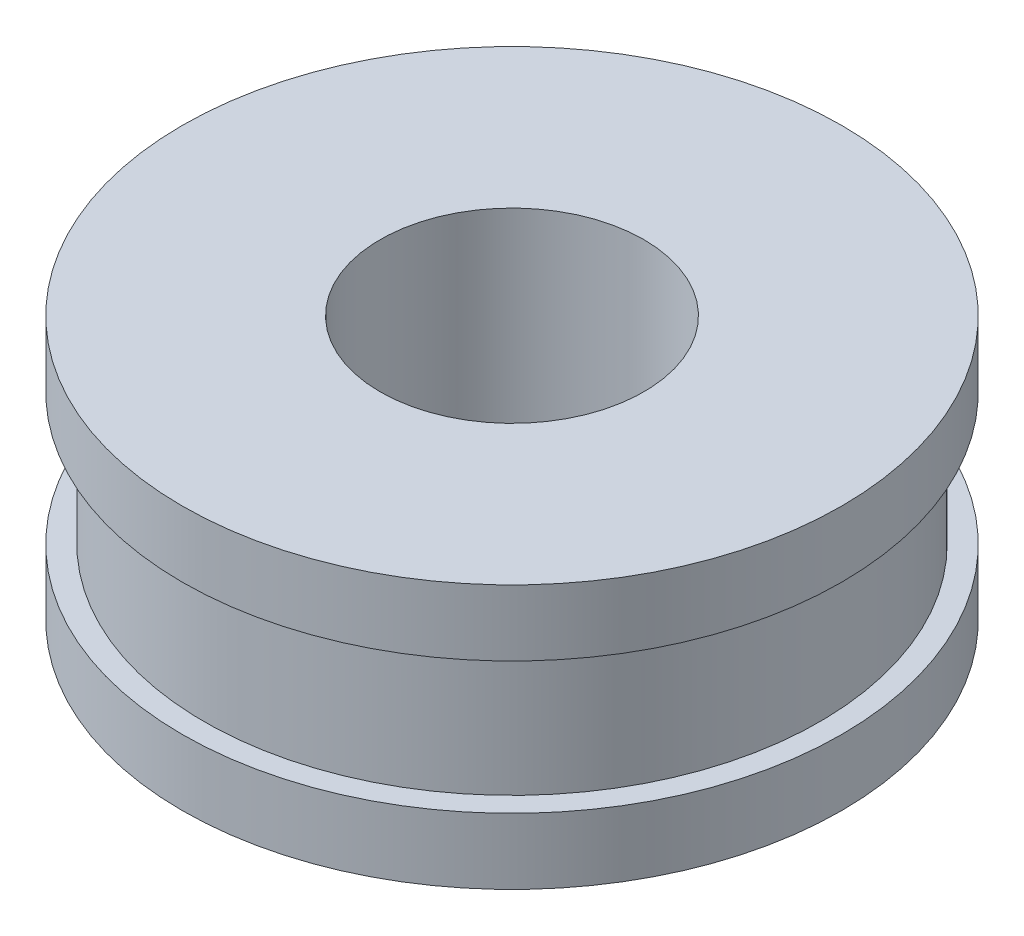
ISO-10303-21;
HEADER;
FILE_DESCRIPTION(('STEP AP214'),'2;1');
FILE_NAME('part.step','',(''),(''),'','','');
FILE_SCHEMA(('AUTOMOTIVE_DESIGN { 1 0 10303 214 1 1 1 1 }'));
ENDSEC;
DATA;
#1=APPLICATION_CONTEXT('core data for automotive mechanical design processes');
#2=APPLICATION_PROTOCOL_DEFINITION('international standard','automotive_design',2000,#1);
#3=PRODUCT_CONTEXT('',#1,'mechanical');
#4=PRODUCT('Part','Part','',(#3));
#5=PRODUCT_RELATED_PRODUCT_CATEGORY('part','',(#4));
#6=PRODUCT_DEFINITION_FORMATION('','',#4);
#7=PRODUCT_DEFINITION_CONTEXT('part definition',#1,'design');
#8=PRODUCT_DEFINITION('design','',#6,#7);
#9=PRODUCT_DEFINITION_SHAPE('','',#8);
#10=(LENGTH_UNIT() NAMED_UNIT(*) SI_UNIT(.MILLI.,.METRE.));
#11=(NAMED_UNIT(*) PLANE_ANGLE_UNIT() SI_UNIT($,.RADIAN.));
#12=(NAMED_UNIT(*) SI_UNIT($,.STERADIAN.) SOLID_ANGLE_UNIT());
#13=UNCERTAINTY_MEASURE_WITH_UNIT(LENGTH_MEASURE(1.E-05),#10,'distance_accuracy_value','');
#14=(GEOMETRIC_REPRESENTATION_CONTEXT(3) GLOBAL_UNCERTAINTY_ASSIGNED_CONTEXT((#13)) GLOBAL_UNIT_ASSIGNED_CONTEXT((#10,
#11,#12)) REPRESENTATION_CONTEXT('',''));
#15=CARTESIAN_POINT('',(0.,0.,0.));
#16=DIRECTION('',(0.,0.,1.));
#17=DIRECTION('',(1.,0.,0.));
#18=AXIS2_PLACEMENT_3D('',#15,#16,#17);
#19=CARTESIAN_POINT('',(0.,6.,0.));
#20=DIRECTION('',(0.,-1.,0.));
#21=DIRECTION('',(0.,0.,-1.));
#22=AXIS2_PLACEMENT_3D('',#19,#20,#21);
#23=CYLINDRICAL_SURFACE('',#22,7.5);
#24=CARTESIAN_POINT('',(0.,1.5,0.));
#25=DIRECTION('',(0.,-1.,0.));
#26=DIRECTION('',(0.,0.,-1.));
#27=AXIS2_PLACEMENT_3D('',#24,#25,#26);
#28=CIRCLE('',#27,7.5);
#29=CARTESIAN_POINT('',(0.,1.5,-7.5));
#30=VERTEX_POINT('',#29);
#31=EDGE_CURVE('E62',#30,#30,#28,.T.);
#32=ORIENTED_EDGE('',*,*,#31,.T.);
#33=EDGE_LOOP('',(#32));
#34=FACE_BOUND('',#33,.T.);
#35=CARTESIAN_POINT('',(0.,0.,0.));
#36=DIRECTION('',(0.,1.,0.));
#37=DIRECTION('',(0.,0.,1.));
#38=AXIS2_PLACEMENT_3D('',#35,#36,#37);
#39=CIRCLE('',#38,7.5);
#40=CARTESIAN_POINT('',(0.,0.,7.5));
#41=VERTEX_POINT('',#40);
#42=EDGE_CURVE('E47',#41,#41,#39,.T.);
#43=ORIENTED_EDGE('',*,*,#42,.T.);
#44=EDGE_LOOP('',(#43));
#45=FACE_BOUND('',#44,.T.);
#46=ADVANCED_FACE('F43',(#34,#45),#23,.T.);
#47=CARTESIAN_POINT('',(0.,6.,0.));
#48=DIRECTION('',(0.,1.,0.));
#49=DIRECTION('',(0.,0.,1.));
#50=AXIS2_PLACEMENT_3D('',#47,#48,#49);
#51=PLANE('',#50);
#52=CARTESIAN_POINT('',(0.,6.,0.));
#53=DIRECTION('',(0.,1.,0.));
#54=DIRECTION('',(0.,0.,1.));
#55=AXIS2_PLACEMENT_3D('',#52,#53,#54);
#56=CIRCLE('',#55,7.5);
#57=CARTESIAN_POINT('',(0.,6.,7.5));
#58=VERTEX_POINT('',#57);
#59=EDGE_CURVE('E10',#58,#58,#56,.T.);
#60=ORIENTED_EDGE('',*,*,#59,.T.);
#61=EDGE_LOOP('',(#60));
#62=FACE_BOUND('',#61,.T.);
#63=CARTESIAN_POINT('',(0.,6.,0.));
#64=DIRECTION('',(0.,1.,0.));
#65=DIRECTION('',(0.,0.,1.));
#66=AXIS2_PLACEMENT_3D('',#63,#64,#65);
#67=CIRCLE('',#66,3.);
#68=CARTESIAN_POINT('',(0.,6.,3.));
#69=VERTEX_POINT('',#68);
#70=EDGE_CURVE('E56',#69,#69,#67,.T.);
#71=ORIENTED_EDGE('',*,*,#70,.F.);
#72=EDGE_LOOP('',(#71));
#73=FACE_BOUND('',#72,.T.);
#74=ADVANCED_FACE('F97',(#62,#73),#51,.T.);
#75=CARTESIAN_POINT('',(0.,0.,0.));
#76=DIRECTION('',(0.,1.,0.));
#77=DIRECTION('',(0.,0.,1.));
#78=AXIS2_PLACEMENT_3D('',#75,#76,#77);
#79=PLANE('',#78);
#80=ORIENTED_EDGE('',*,*,#42,.F.);
#81=EDGE_LOOP('',(#80));
#82=FACE_BOUND('',#81,.T.);
#83=CARTESIAN_POINT('',(0.,0.,0.));
#84=DIRECTION('',(0.,1.,0.));
#85=DIRECTION('',(0.,0.,1.));
#86=AXIS2_PLACEMENT_3D('',#83,#84,#85);
#87=CIRCLE('',#86,3.);
#88=CARTESIAN_POINT('',(0.,0.,3.));
#89=VERTEX_POINT('',#88);
#90=EDGE_CURVE('E58',#89,#89,#87,.T.);
#91=ORIENTED_EDGE('',*,*,#90,.T.);
#92=EDGE_LOOP('',(#91));
#93=FACE_BOUND('',#92,.T.);
#94=ADVANCED_FACE('F87',(#82,#93),#79,.F.);
#95=CARTESIAN_POINT('',(0.,4.5,0.));
#96=DIRECTION('',(0.,-1.,0.));
#97=DIRECTION('',(0.,0.,-1.));
#98=AXIS2_PLACEMENT_3D('',#95,#96,#97);
#99=CIRCLE('',#98,7.5);
#100=CARTESIAN_POINT('',(0.,4.5,-7.5));
#101=VERTEX_POINT('',#100);
#102=EDGE_CURVE('E77',#101,#101,#99,.T.);
#103=ORIENTED_EDGE('',*,*,#102,.F.);
#104=EDGE_LOOP('',(#103));
#105=FACE_BOUND('',#104,.T.);
#106=ORIENTED_EDGE('',*,*,#59,.F.);
#107=EDGE_LOOP('',(#106));
#108=FACE_BOUND('',#107,.T.);
#109=ADVANCED_FACE('F45',(#105,#108),#23,.T.);
#110=CARTESIAN_POINT('',(0.,6.,0.));
#111=DIRECTION('',(0.,-1.,0.));
#112=DIRECTION('',(0.,0.,-1.));
#113=AXIS2_PLACEMENT_3D('',#110,#111,#112);
#114=CYLINDRICAL_SURFACE('',#113,3.);
#115=ORIENTED_EDGE('',*,*,#70,.T.);
#116=EDGE_LOOP('',(#115));
#117=FACE_BOUND('',#116,.T.);
#118=ORIENTED_EDGE('',*,*,#90,.F.);
#119=EDGE_LOOP('',(#118));
#120=FACE_BOUND('',#119,.T.);
#121=ADVANCED_FACE('F86',(#117,#120),#114,.F.);
#122=CARTESIAN_POINT('',(0.,1.5,-7.5));
#123=DIRECTION('',(0.,-1.,0.));
#124=DIRECTION('',(0.,0.,-1.));
#125=AXIS2_PLACEMENT_3D('',#122,#123,#124);
#126=PLANE('',#125);
#127=ORIENTED_EDGE('',*,*,#31,.F.);
#128=EDGE_LOOP('',(#127));
#129=FACE_BOUND('',#128,.T.);
#130=CARTESIAN_POINT('',(0.,1.5,0.));
#131=DIRECTION('',(0.,-1.,0.));
#132=DIRECTION('',(0.,0.,-1.));
#133=AXIS2_PLACEMENT_3D('',#130,#131,#132);
#134=CIRCLE('',#133,7.);
#135=CARTESIAN_POINT('',(0.,1.5,-7.));
#136=VERTEX_POINT('',#135);
#137=EDGE_CURVE('E69',#136,#136,#134,.T.);
#138=ORIENTED_EDGE('',*,*,#137,.T.);
#139=EDGE_LOOP('',(#138));
#140=FACE_BOUND('',#139,.T.);
#141=ADVANCED_FACE('F93',(#129,#140),#126,.F.);
#142=CARTESIAN_POINT('',(0.,0.,0.));
#143=DIRECTION('',(0.,-1.,0.));
#144=DIRECTION('',(0.,0.,-1.));
#145=AXIS2_PLACEMENT_3D('',#142,#143,#144);
#146=CYLINDRICAL_SURFACE('',#145,7.);
#147=ORIENTED_EDGE('',*,*,#137,.F.);
#148=EDGE_LOOP('',(#147));
#149=FACE_BOUND('',#148,.T.);
#150=CARTESIAN_POINT('',(0.,4.5,0.));
#151=DIRECTION('',(0.,-1.,0.));
#152=DIRECTION('',(0.,0.,-1.));
#153=AXIS2_PLACEMENT_3D('',#150,#151,#152);
#154=CIRCLE('',#153,7.);
#155=CARTESIAN_POINT('',(0.,4.5,-7.));
#156=VERTEX_POINT('',#155);
#157=EDGE_CURVE('E73',#156,#156,#154,.T.);
#158=ORIENTED_EDGE('',*,*,#157,.T.);
#159=EDGE_LOOP('',(#158));
#160=FACE_BOUND('',#159,.T.);
#161=ADVANCED_FACE('F112',(#149,#160),#146,.T.);
#162=CARTESIAN_POINT('',(0.,4.5,-7.));
#163=DIRECTION('',(0.,1.,0.));
#164=DIRECTION('',(0.,0.,1.));
#165=AXIS2_PLACEMENT_3D('',#162,#163,#164);
#166=PLANE('',#165);
#167=ORIENTED_EDGE('',*,*,#157,.F.);
#168=EDGE_LOOP('',(#167));
#169=FACE_BOUND('',#168,.T.);
#170=ORIENTED_EDGE('',*,*,#102,.T.);
#171=EDGE_LOOP('',(#170));
#172=FACE_BOUND('',#171,.T.);
#173=ADVANCED_FACE('F82',(#169,#172),#166,.F.);
#174=CLOSED_SHELL('',(#46,#74,#94,#109,#121,#141,#161,#173));
#175=MANIFOLD_SOLID_BREP('B2',#174);
#176=ADVANCED_BREP_SHAPE_REPRESENTATION('',(#18,#175),#14);
#177=SHAPE_DEFINITION_REPRESENTATION(#9,#176);
ENDSEC;
END-ISO-10303-21;
